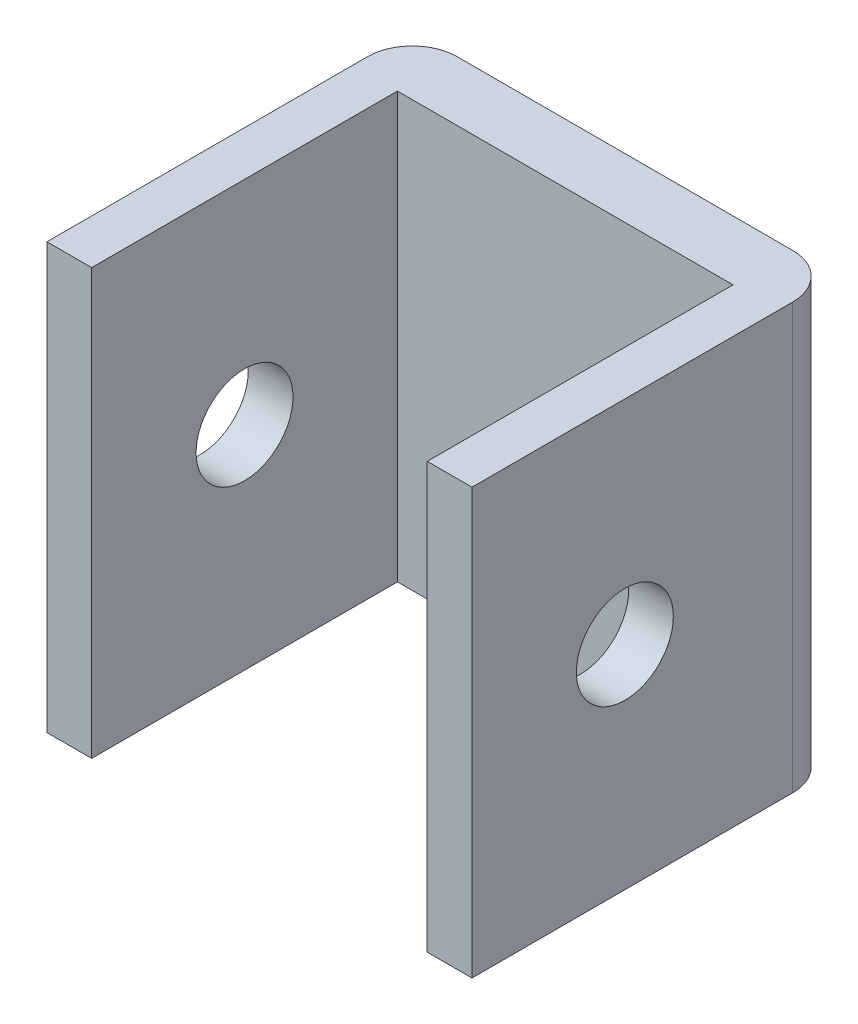
ISO-10303-21;
HEADER;
FILE_DESCRIPTION(('STEP AP214'),'2;1');
FILE_NAME('part.step','',(''),(''),'','','');
FILE_SCHEMA(('AUTOMOTIVE_DESIGN { 1 0 10303 214 1 1 1 1 }'));
ENDSEC;
DATA;
#1=APPLICATION_CONTEXT('core data for automotive mechanical design processes');
#2=APPLICATION_PROTOCOL_DEFINITION('international standard','automotive_design',2000,#1);
#3=PRODUCT_CONTEXT('',#1,'mechanical');
#4=PRODUCT('Part','Part','',(#3));
#5=PRODUCT_RELATED_PRODUCT_CATEGORY('part','',(#4));
#6=PRODUCT_DEFINITION_FORMATION('','',#4);
#7=PRODUCT_DEFINITION_CONTEXT('part definition',#1,'design');
#8=PRODUCT_DEFINITION('design','',#6,#7);
#9=PRODUCT_DEFINITION_SHAPE('','',#8);
#10=(LENGTH_UNIT() NAMED_UNIT(*) SI_UNIT(.MILLI.,.METRE.));
#11=(NAMED_UNIT(*) PLANE_ANGLE_UNIT() SI_UNIT($,.RADIAN.));
#12=(NAMED_UNIT(*) SI_UNIT($,.STERADIAN.) SOLID_ANGLE_UNIT());
#13=UNCERTAINTY_MEASURE_WITH_UNIT(LENGTH_MEASURE(1.E-05),#10,'distance_accuracy_value','');
#14=(GEOMETRIC_REPRESENTATION_CONTEXT(3) GLOBAL_UNCERTAINTY_ASSIGNED_CONTEXT((#13)) GLOBAL_UNIT_ASSIGNED_CONTEXT((#10,
#11,#12)) REPRESENTATION_CONTEXT('',''));
#15=CARTESIAN_POINT('',(0.,0.,0.));
#16=DIRECTION('',(0.,0.,1.));
#17=DIRECTION('',(1.,0.,0.));
#18=AXIS2_PLACEMENT_3D('',#15,#16,#17);
#19=CARTESIAN_POINT('',(-11.25,-14.25,-9.25));
#20=DIRECTION('',(0.,1.,0.));
#21=DIRECTION('',(0.,0.,1.));
#22=AXIS2_PLACEMENT_3D('',#19,#20,#21);
#23=CYLINDRICAL_SURFACE('',#22,3.);
#24=DIRECTION('',(0.,1.,0.));
#25=VECTOR('',#24,1.);
#26=CARTESIAN_POINT('',(-14.25,-14.25,-9.24999999999998));
#27=LINE('',#26,#25);
#28=CARTESIAN_POINT('',(-14.25,-14.25,-9.24999999999998));
#29=VERTEX_POINT('',#28);
#30=CARTESIAN_POINT('',(-14.25,14.25,-9.24999999999998));
#31=VERTEX_POINT('',#30);
#32=EDGE_CURVE('E118',#29,#31,#27,.T.);
#33=ORIENTED_EDGE('',*,*,#32,.T.);
#34=CARTESIAN_POINT('',(-11.25,14.25,-9.25));
#35=DIRECTION('',(0.,1.,0.));
#36=DIRECTION('',(0.,0.,1.));
#37=AXIS2_PLACEMENT_3D('',#34,#35,#36);
#38=CIRCLE('',#37,3.);
#39=CARTESIAN_POINT('',(-11.25,14.25,-12.25));
#40=VERTEX_POINT('',#39);
#41=EDGE_CURVE('E121',#31,#40,#38,.F.);
#42=ORIENTED_EDGE('',*,*,#41,.T.);
#43=DIRECTION('',(0.,1.,0.));
#44=VECTOR('',#43,1.);
#45=CARTESIAN_POINT('',(-11.25,-14.25,-12.25));
#46=LINE('',#45,#44);
#47=CARTESIAN_POINT('',(-11.25,-14.25,-12.25));
#48=VERTEX_POINT('',#47);
#49=EDGE_CURVE('E50',#48,#40,#46,.T.);
#50=ORIENTED_EDGE('',*,*,#49,.F.);
#51=CARTESIAN_POINT('',(-11.25,-14.25,-9.25));
#52=DIRECTION('',(0.,1.,0.));
#53=DIRECTION('',(0.,0.,1.));
#54=AXIS2_PLACEMENT_3D('',#51,#52,#53);
#55=CIRCLE('',#54,3.);
#56=EDGE_CURVE('E123',#29,#48,#55,.F.);
#57=ORIENTED_EDGE('',*,*,#56,.F.);
#58=EDGE_LOOP('',(#33,#42,#50,#57));
#59=FACE_BOUND('',#58,.T.);
#60=ADVANCED_FACE('F41',(#59),#23,.T.);
#61=CARTESIAN_POINT('',(0.,-14.25,-12.25));
#62=DIRECTION('',(0.,0.,1.));
#63=DIRECTION('',(1.,0.,0.));
#64=AXIS2_PLACEMENT_3D('',#61,#62,#63);
#65=PLANE('',#64);
#66=CARTESIAN_POINT('',(0.,0.,-12.25));
#67=DIRECTION('',(0.,0.,1.));
#68=DIRECTION('',(1.,0.,0.));
#69=AXIS2_PLACEMENT_3D('',#66,#67,#68);
#70=CIRCLE('',#69,5.);
#71=CARTESIAN_POINT('',(5.,0.,-12.25));
#72=VERTEX_POINT('',#71);
#73=EDGE_CURVE('E11',#72,#72,#70,.F.);
#74=ORIENTED_EDGE('',*,*,#73,.F.);
#75=EDGE_LOOP('',(#74));
#76=FACE_BOUND('',#75,.T.);
#77=ORIENTED_EDGE('',*,*,#49,.T.);
#78=DIRECTION('',(1.,0.,0.));
#79=VECTOR('',#78,1.);
#80=CARTESIAN_POINT('',(0.,14.25,-12.25));
#81=LINE('',#80,#79);
#82=CARTESIAN_POINT('',(11.25,14.25,-12.25));
#83=VERTEX_POINT('',#82);
#84=EDGE_CURVE('E137',#40,#83,#81,.T.);
#85=ORIENTED_EDGE('',*,*,#84,.T.);
#86=DIRECTION('',(0.,1.,0.));
#87=VECTOR('',#86,1.);
#88=CARTESIAN_POINT('',(11.25,-14.25,-12.25));
#89=LINE('',#88,#87);
#90=CARTESIAN_POINT('',(11.25,-14.25,-12.25));
#91=VERTEX_POINT('',#90);
#92=EDGE_CURVE('E205',#91,#83,#89,.T.);
#93=ORIENTED_EDGE('',*,*,#92,.F.);
#94=DIRECTION('',(1.,0.,0.));
#95=VECTOR('',#94,1.);
#96=CARTESIAN_POINT('',(0.,-14.25,-12.25));
#97=LINE('',#96,#95);
#98=EDGE_CURVE('E58',#48,#91,#97,.T.);
#99=ORIENTED_EDGE('',*,*,#98,.F.);
#100=EDGE_LOOP('',(#77,#85,#93,#99));
#101=FACE_BOUND('',#100,.T.);
#102=ADVANCED_FACE('F264',(#76,#101),#65,.F.);
#103=CARTESIAN_POINT('',(11.25,-14.25,-9.25));
#104=DIRECTION('',(0.,1.,0.));
#105=DIRECTION('',(0.,0.,1.));
#106=AXIS2_PLACEMENT_3D('',#103,#104,#105);
#107=CYLINDRICAL_SURFACE('',#106,3.);
#108=ORIENTED_EDGE('',*,*,#92,.T.);
#109=CARTESIAN_POINT('',(11.25,14.25,-9.25));
#110=DIRECTION('',(0.,1.,0.));
#111=DIRECTION('',(0.,0.,1.));
#112=AXIS2_PLACEMENT_3D('',#109,#110,#111);
#113=CIRCLE('',#112,3.);
#114=CARTESIAN_POINT('',(14.25,14.25,-9.24999999999998));
#115=VERTEX_POINT('',#114);
#116=EDGE_CURVE('E167',#83,#115,#113,.F.);
#117=ORIENTED_EDGE('',*,*,#116,.T.);
#118=DIRECTION('',(0.,1.,0.));
#119=VECTOR('',#118,1.);
#120=CARTESIAN_POINT('',(14.25,-14.25,-9.24999999999998));
#121=LINE('',#120,#119);
#122=CARTESIAN_POINT('',(14.25,-14.25,-9.24999999999998));
#123=VERTEX_POINT('',#122);
#124=EDGE_CURVE('E208',#123,#115,#121,.T.);
#125=ORIENTED_EDGE('',*,*,#124,.F.);
#126=CARTESIAN_POINT('',(11.25,-14.25,-9.25));
#127=DIRECTION('',(0.,1.,0.));
#128=DIRECTION('',(0.,0.,1.));
#129=AXIS2_PLACEMENT_3D('',#126,#127,#128);
#130=CIRCLE('',#129,3.);
#131=EDGE_CURVE('E198',#91,#123,#130,.F.);
#132=ORIENTED_EDGE('',*,*,#131,.F.);
#133=EDGE_LOOP('',(#108,#117,#125,#132));
#134=FACE_BOUND('',#133,.T.);
#135=ADVANCED_FACE('F266',(#134),#107,.T.);
#136=CARTESIAN_POINT('',(14.25,-14.25,0.));
#137=DIRECTION('',(1.,0.,0.));
#138=DIRECTION('',(0.,0.,-1.));
#139=AXIS2_PLACEMENT_3D('',#136,#137,#138);
#140=PLANE('',#139);
#141=CARTESIAN_POINT('',(14.25,0.,2.));
#142=DIRECTION('',(1.,0.,0.));
#143=DIRECTION('',(0.,0.,-1.));
#144=AXIS2_PLACEMENT_3D('',#141,#142,#143);
#145=CIRCLE('',#144,3.25);
#146=CARTESIAN_POINT('',(14.25,0.,-1.25));
#147=VERTEX_POINT('',#146);
#148=EDGE_CURVE('E419',#147,#147,#145,.T.);
#149=ORIENTED_EDGE('',*,*,#148,.F.);
#150=EDGE_LOOP('',(#149));
#151=FACE_BOUND('',#150,.T.);
#152=ORIENTED_EDGE('',*,*,#124,.T.);
#153=DIRECTION('',(0.,0.,-1.));
#154=VECTOR('',#153,1.);
#155=CARTESIAN_POINT('',(14.25,14.25,0.));
#156=LINE('',#155,#154);
#157=CARTESIAN_POINT('',(14.25,14.25,12.25));
#158=VERTEX_POINT('',#157);
#159=EDGE_CURVE('E163',#158,#115,#156,.T.);
#160=ORIENTED_EDGE('',*,*,#159,.F.);
#161=DIRECTION('',(0.,1.,0.));
#162=VECTOR('',#161,1.);
#163=CARTESIAN_POINT('',(14.25,-14.25,12.25));
#164=LINE('',#163,#162);
#165=CARTESIAN_POINT('',(14.25,-14.25,12.25));
#166=VERTEX_POINT('',#165);
#167=EDGE_CURVE('E211',#166,#158,#164,.T.);
#168=ORIENTED_EDGE('',*,*,#167,.F.);
#169=DIRECTION('',(0.,0.,-1.));
#170=VECTOR('',#169,1.);
#171=CARTESIAN_POINT('',(14.25,-14.25,0.));
#172=LINE('',#171,#170);
#173=EDGE_CURVE('E194',#166,#123,#172,.T.);
#174=ORIENTED_EDGE('',*,*,#173,.T.);
#175=EDGE_LOOP('',(#152,#160,#168,#174));
#176=FACE_BOUND('',#175,.T.);
#177=ADVANCED_FACE('F285',(#151,#176),#140,.T.);
#178=CARTESIAN_POINT('',(0.,-14.25,12.25));
#179=DIRECTION('',(0.,0.,1.));
#180=DIRECTION('',(1.,0.,0.));
#181=AXIS2_PLACEMENT_3D('',#178,#179,#180);
#182=PLANE('',#181);
#183=ORIENTED_EDGE('',*,*,#167,.T.);
#184=DIRECTION('',(1.,0.,0.));
#185=VECTOR('',#184,1.);
#186=CARTESIAN_POINT('',(0.,14.25,12.25));
#187=LINE('',#186,#185);
#188=CARTESIAN_POINT('',(11.25,14.25,12.25));
#189=VERTEX_POINT('',#188);
#190=EDGE_CURVE('E149',#189,#158,#187,.T.);
#191=ORIENTED_EDGE('',*,*,#190,.F.);
#192=DIRECTION('',(0.,1.,0.));
#193=VECTOR('',#192,1.);
#194=CARTESIAN_POINT('',(11.25,-14.25,12.25));
#195=LINE('',#194,#193);
#196=CARTESIAN_POINT('',(11.25,-14.25,12.25));
#197=VERTEX_POINT('',#196);
#198=EDGE_CURVE('E214',#197,#189,#195,.T.);
#199=ORIENTED_EDGE('',*,*,#198,.F.);
#200=DIRECTION('',(1.,0.,0.));
#201=VECTOR('',#200,1.);
#202=CARTESIAN_POINT('',(0.,-14.25,12.25));
#203=LINE('',#202,#201);
#204=EDGE_CURVE('E183',#197,#166,#203,.T.);
#205=ORIENTED_EDGE('',*,*,#204,.T.);
#206=EDGE_LOOP('',(#183,#191,#199,#205));
#207=FACE_BOUND('',#206,.T.);
#208=ADVANCED_FACE('F278',(#207),#182,.T.);
#209=CARTESIAN_POINT('',(11.25,-14.25,0.));
#210=DIRECTION('',(-1.,0.,0.));
#211=DIRECTION('',(0.,0.,1.));
#212=AXIS2_PLACEMENT_3D('',#209,#210,#211);
#213=PLANE('',#212);
#214=CARTESIAN_POINT('',(11.25,0.,2.));
#215=DIRECTION('',(-1.,0.,0.));
#216=DIRECTION('',(0.,0.,1.));
#217=AXIS2_PLACEMENT_3D('',#214,#215,#216);
#218=CIRCLE('',#217,3.25);
#219=CARTESIAN_POINT('',(11.25,0.,5.25));
#220=VERTEX_POINT('',#219);
#221=EDGE_CURVE('E240',#220,#220,#218,.T.);
#222=ORIENTED_EDGE('',*,*,#221,.F.);
#223=EDGE_LOOP('',(#222));
#224=FACE_BOUND('',#223,.T.);
#225=ORIENTED_EDGE('',*,*,#198,.T.);
#226=DIRECTION('',(0.,0.,1.));
#227=VECTOR('',#226,1.);
#228=CARTESIAN_POINT('',(11.25,14.25,0.));
#229=LINE('',#228,#227);
#230=CARTESIAN_POINT('',(11.25,14.25,-8.25));
#231=VERTEX_POINT('',#230);
#232=EDGE_CURVE('E159',#231,#189,#229,.T.);
#233=ORIENTED_EDGE('',*,*,#232,.F.);
#234=DIRECTION('',(0.,1.,0.));
#235=VECTOR('',#234,1.);
#236=CARTESIAN_POINT('',(11.25,-14.25,-8.25));
#237=LINE('',#236,#235);
#238=CARTESIAN_POINT('',(11.25,-14.25,-8.25));
#239=VERTEX_POINT('',#238);
#240=EDGE_CURVE('E217',#239,#231,#237,.T.);
#241=ORIENTED_EDGE('',*,*,#240,.F.);
#242=DIRECTION('',(0.,0.,1.));
#243=VECTOR('',#242,1.);
#244=CARTESIAN_POINT('',(11.25,-14.25,0.));
#245=LINE('',#244,#243);
#246=EDGE_CURVE('E190',#239,#197,#245,.T.);
#247=ORIENTED_EDGE('',*,*,#246,.T.);
#248=EDGE_LOOP('',(#225,#233,#241,#247));
#249=FACE_BOUND('',#248,.T.);
#250=ADVANCED_FACE('F293',(#224,#249),#213,.T.);
#251=CARTESIAN_POINT('',(0.,-14.25,-8.25));
#252=DIRECTION('',(0.,0.,1.));
#253=DIRECTION('',(1.,0.,0.));
#254=AXIS2_PLACEMENT_3D('',#251,#252,#253);
#255=PLANE('',#254);
#256=CARTESIAN_POINT('',(0.,0.,-8.25));
#257=DIRECTION('',(0.,0.,1.));
#258=DIRECTION('',(1.,0.,0.));
#259=AXIS2_PLACEMENT_3D('',#256,#257,#258);
#260=CIRCLE('',#259,1.5);
#261=CARTESIAN_POINT('',(1.5,0.,-8.25));
#262=VERTEX_POINT('',#261);
#263=EDGE_CURVE('E227',#262,#262,#260,.T.);
#264=ORIENTED_EDGE('',*,*,#263,.F.);
#265=EDGE_LOOP('',(#264));
#266=FACE_BOUND('',#265,.T.);
#267=ORIENTED_EDGE('',*,*,#240,.T.);
#268=DIRECTION('',(1.,0.,0.));
#269=VECTOR('',#268,1.);
#270=CARTESIAN_POINT('',(0.,14.25,-8.25));
#271=LINE('',#270,#269);
#272=CARTESIAN_POINT('',(-11.25,14.25,-8.25));
#273=VERTEX_POINT('',#272);
#274=EDGE_CURVE('E155',#273,#231,#271,.T.);
#275=ORIENTED_EDGE('',*,*,#274,.F.);
#276=DIRECTION('',(0.,1.,0.));
#277=VECTOR('',#276,1.);
#278=CARTESIAN_POINT('',(-11.25,-14.25,-8.25));
#279=LINE('',#278,#277);
#280=CARTESIAN_POINT('',(-11.25,-14.25,-8.25));
#281=VERTEX_POINT('',#280);
#282=EDGE_CURVE('E220',#281,#273,#279,.T.);
#283=ORIENTED_EDGE('',*,*,#282,.F.);
#284=DIRECTION('',(1.,0.,0.));
#285=VECTOR('',#284,1.);
#286=CARTESIAN_POINT('',(0.,-14.25,-8.25));
#287=LINE('',#286,#285);
#288=EDGE_CURVE('E186',#281,#239,#287,.T.);
#289=ORIENTED_EDGE('',*,*,#288,.T.);
#290=EDGE_LOOP('',(#267,#275,#283,#289));
#291=FACE_BOUND('',#290,.T.);
#292=ADVANCED_FACE('F430',(#266,#291),#255,.T.);
#293=CARTESIAN_POINT('',(-11.25,-14.25,0.));
#294=DIRECTION('',(-1.,0.,0.));
#295=DIRECTION('',(0.,0.,1.));
#296=AXIS2_PLACEMENT_3D('',#293,#294,#295);
#297=PLANE('',#296);
#298=CARTESIAN_POINT('',(-11.25,0.,2.));
#299=DIRECTION('',(-1.,0.,0.));
#300=DIRECTION('',(0.,0.,1.));
#301=AXIS2_PLACEMENT_3D('',#298,#299,#300);
#302=CIRCLE('',#301,3.25);
#303=CARTESIAN_POINT('',(-11.25,0.,5.25));
#304=VERTEX_POINT('',#303);
#305=EDGE_CURVE('E246',#304,#304,#302,.T.);
#306=ORIENTED_EDGE('',*,*,#305,.T.);
#307=EDGE_LOOP('',(#306));
#308=FACE_BOUND('',#307,.T.);
#309=ORIENTED_EDGE('',*,*,#282,.T.);
#310=DIRECTION('',(0.,0.,1.));
#311=VECTOR('',#310,1.);
#312=CARTESIAN_POINT('',(-11.25,14.25,0.));
#313=LINE('',#312,#311);
#314=CARTESIAN_POINT('',(-11.25,14.25,12.25));
#315=VERTEX_POINT('',#314);
#316=EDGE_CURVE('E147',#273,#315,#313,.T.);
#317=ORIENTED_EDGE('',*,*,#316,.T.);
#318=DIRECTION('',(0.,1.,0.));
#319=VECTOR('',#318,1.);
#320=CARTESIAN_POINT('',(-11.25,-14.25,12.25));
#321=LINE('',#320,#319);
#322=CARTESIAN_POINT('',(-11.25,-14.25,12.25));
#323=VERTEX_POINT('',#322);
#324=EDGE_CURVE('E223',#323,#315,#321,.T.);
#325=ORIENTED_EDGE('',*,*,#324,.F.);
#326=DIRECTION('',(0.,0.,1.));
#327=VECTOR('',#326,1.);
#328=CARTESIAN_POINT('',(-11.25,-14.25,0.));
#329=LINE('',#328,#327);
#330=EDGE_CURVE('E182',#281,#323,#329,.T.);
#331=ORIENTED_EDGE('',*,*,#330,.F.);
#332=EDGE_LOOP('',(#309,#317,#325,#331));
#333=FACE_BOUND('',#332,.T.);
#334=ADVANCED_FACE('F329',(#308,#333),#297,.F.);
#335=ORIENTED_EDGE('',*,*,#324,.T.);
#336=CARTESIAN_POINT('',(-14.25,14.25,12.25));
#337=VERTEX_POINT('',#336);
#338=EDGE_CURVE('E144',#337,#315,#187,.T.);
#339=ORIENTED_EDGE('',*,*,#338,.F.);
#340=DIRECTION('',(0.,1.,0.));
#341=VECTOR('',#340,1.);
#342=CARTESIAN_POINT('',(-14.25,-14.25,12.25));
#343=LINE('',#342,#341);
#344=CARTESIAN_POINT('',(-14.25,-14.25,12.25));
#345=VERTEX_POINT('',#344);
#346=EDGE_CURVE('E128',#345,#337,#343,.T.);
#347=ORIENTED_EDGE('',*,*,#346,.F.);
#348=EDGE_CURVE('E178',#345,#323,#203,.T.);
#349=ORIENTED_EDGE('',*,*,#348,.T.);
#350=EDGE_LOOP('',(#335,#339,#347,#349));
#351=FACE_BOUND('',#350,.T.);
#352=ADVANCED_FACE('F295',(#351),#182,.T.);
#353=CARTESIAN_POINT('',(-14.25,-14.25,0.));
#354=DIRECTION('',(1.,0.,0.));
#355=DIRECTION('',(0.,0.,-1.));
#356=AXIS2_PLACEMENT_3D('',#353,#354,#355);
#357=PLANE('',#356);
#358=CARTESIAN_POINT('',(-14.25,0.,2.));
#359=DIRECTION('',(1.,0.,0.));
#360=DIRECTION('',(0.,0.,-1.));
#361=AXIS2_PLACEMENT_3D('',#358,#359,#360);
#362=CIRCLE('',#361,3.25);
#363=CARTESIAN_POINT('',(-14.25,0.,-1.25));
#364=VERTEX_POINT('',#363);
#365=EDGE_CURVE('E44',#364,#364,#362,.T.);
#366=ORIENTED_EDGE('',*,*,#365,.T.);
#367=EDGE_LOOP('',(#366));
#368=FACE_BOUND('',#367,.T.);
#369=ORIENTED_EDGE('',*,*,#346,.T.);
#370=DIRECTION('',(0.,0.,-1.));
#371=VECTOR('',#370,1.);
#372=CARTESIAN_POINT('',(-14.25,14.25,0.));
#373=LINE('',#372,#371);
#374=EDGE_CURVE('E134',#337,#31,#373,.T.);
#375=ORIENTED_EDGE('',*,*,#374,.T.);
#376=ORIENTED_EDGE('',*,*,#32,.F.);
#377=DIRECTION('',(0.,0.,-1.));
#378=VECTOR('',#377,1.);
#379=CARTESIAN_POINT('',(-14.25,-14.25,0.));
#380=LINE('',#379,#378);
#381=EDGE_CURVE('E175',#345,#29,#380,.T.);
#382=ORIENTED_EDGE('',*,*,#381,.F.);
#383=EDGE_LOOP('',(#369,#375,#376,#382));
#384=FACE_BOUND('',#383,.T.);
#385=ADVANCED_FACE('F141',(#368,#384),#357,.F.);
#386=CARTESIAN_POINT('',(0.,-14.25,0.));
#387=DIRECTION('',(0.,1.,0.));
#388=DIRECTION('',(0.,0.,1.));
#389=AXIS2_PLACEMENT_3D('',#386,#387,#388);
#390=PLANE('',#389);
#391=ORIENTED_EDGE('',*,*,#56,.T.);
#392=ORIENTED_EDGE('',*,*,#98,.T.);
#393=ORIENTED_EDGE('',*,*,#131,.T.);
#394=ORIENTED_EDGE('',*,*,#173,.F.);
#395=ORIENTED_EDGE('',*,*,#204,.F.);
#396=ORIENTED_EDGE('',*,*,#246,.F.);
#397=ORIENTED_EDGE('',*,*,#288,.F.);
#398=ORIENTED_EDGE('',*,*,#330,.T.);
#399=ORIENTED_EDGE('',*,*,#348,.F.);
#400=ORIENTED_EDGE('',*,*,#381,.T.);
#401=EDGE_LOOP('',(#391,#392,#393,#394,#395,#396,#397,#398,#399,#400));
#402=FACE_BOUND('',#401,.T.);
#403=ADVANCED_FACE('F272',(#402),#390,.F.);
#404=CARTESIAN_POINT('',(0.,14.25,0.));
#405=DIRECTION('',(0.,1.,0.));
#406=DIRECTION('',(0.,0.,1.));
#407=AXIS2_PLACEMENT_3D('',#404,#405,#406);
#408=PLANE('',#407);
#409=ORIENTED_EDGE('',*,*,#41,.F.);
#410=ORIENTED_EDGE('',*,*,#374,.F.);
#411=ORIENTED_EDGE('',*,*,#338,.T.);
#412=ORIENTED_EDGE('',*,*,#316,.F.);
#413=ORIENTED_EDGE('',*,*,#274,.T.);
#414=ORIENTED_EDGE('',*,*,#232,.T.);
#415=ORIENTED_EDGE('',*,*,#190,.T.);
#416=ORIENTED_EDGE('',*,*,#159,.T.);
#417=ORIENTED_EDGE('',*,*,#116,.F.);
#418=ORIENTED_EDGE('',*,*,#84,.F.);
#419=EDGE_LOOP('',(#409,#410,#411,#412,#413,#414,#415,#416,#417,#418));
#420=FACE_BOUND('',#419,.T.);
#421=ADVANCED_FACE('F132',(#420),#408,.T.);
#422=CARTESIAN_POINT('',(0.,0.,-19.25));
#423=DIRECTION('',(0.,0.,1.));
#424=DIRECTION('',(1.,0.,0.));
#425=AXIS2_PLACEMENT_3D('',#422,#423,#424);
#426=CYLINDRICAL_SURFACE('',#425,5.);
#427=CARTESIAN_POINT('',(0.,0.,-19.25));
#428=DIRECTION('',(0.,0.,-1.));
#429=DIRECTION('',(-1.,0.,0.));
#430=AXIS2_PLACEMENT_3D('',#427,#428,#429);
#431=CIRCLE('',#430,5.);
#432=CARTESIAN_POINT('',(-5.,0.,-19.25));
#433=VERTEX_POINT('',#432);
#434=EDGE_CURVE('E139',#433,#433,#431,.T.);
#435=ORIENTED_EDGE('',*,*,#434,.F.);
#436=EDGE_LOOP('',(#435));
#437=FACE_BOUND('',#436,.T.);
#438=ORIENTED_EDGE('',*,*,#73,.T.);
#439=EDGE_LOOP('',(#438));
#440=FACE_BOUND('',#439,.T.);
#441=ADVANCED_FACE('F258',(#437,#440),#426,.T.);
#442=CARTESIAN_POINT('',(0.,0.,-19.25));
#443=DIRECTION('',(0.,0.,-1.));
#444=DIRECTION('',(-1.,0.,0.));
#445=AXIS2_PLACEMENT_3D('',#442,#443,#444);
#446=PLANE('',#445);
#447=CARTESIAN_POINT('',(0.,0.,-19.25));
#448=DIRECTION('',(0.,0.,-1.));
#449=DIRECTION('',(-1.,0.,0.));
#450=AXIS2_PLACEMENT_3D('',#447,#448,#449);
#451=CIRCLE('',#450,2.25);
#452=CARTESIAN_POINT('',(-2.25,0.,-19.25));
#453=VERTEX_POINT('',#452);
#454=EDGE_CURVE('E230',#453,#453,#451,.T.);
#455=ORIENTED_EDGE('',*,*,#454,.F.);
#456=EDGE_LOOP('',(#455));
#457=FACE_BOUND('',#456,.T.);
#458=ORIENTED_EDGE('',*,*,#434,.T.);
#459=EDGE_LOOP('',(#458));
#460=FACE_BOUND('',#459,.T.);
#461=ADVANCED_FACE('F256',(#457,#460),#446,.T.);
#462=CARTESIAN_POINT('',(0.,0.,-17.75));
#463=DIRECTION('',(0.,0.,-1.));
#464=DIRECTION('',(-1.,0.,0.));
#465=AXIS2_PLACEMENT_3D('',#462,#463,#464);
#466=CYLINDRICAL_SURFACE('',#465,2.25);
#467=CARTESIAN_POINT('',(0.,0.,-17.75));
#468=DIRECTION('',(0.,0.,-1.));
#469=DIRECTION('',(-1.,0.,0.));
#470=AXIS2_PLACEMENT_3D('',#467,#468,#469);
#471=CIRCLE('',#470,2.25);
#472=CARTESIAN_POINT('',(-2.25,0.,-17.75));
#473=VERTEX_POINT('',#472);
#474=EDGE_CURVE('E237',#473,#473,#471,.T.);
#475=ORIENTED_EDGE('',*,*,#474,.F.);
#476=EDGE_LOOP('',(#475));
#477=FACE_BOUND('',#476,.T.);
#478=ORIENTED_EDGE('',*,*,#454,.T.);
#479=EDGE_LOOP('',(#478));
#480=FACE_BOUND('',#479,.T.);
#481=ADVANCED_FACE('F359',(#477,#480),#466,.F.);
#482=CARTESIAN_POINT('',(0.,0.,-17.75));
#483=DIRECTION('',(0.,0.,-1.));
#484=DIRECTION('',(-1.,0.,0.));
#485=AXIS2_PLACEMENT_3D('',#482,#483,#484);
#486=PLANE('',#485);
#487=CARTESIAN_POINT('',(0.,0.,-17.75));
#488=DIRECTION('',(0.,0.,-1.));
#489=DIRECTION('',(-1.,0.,0.));
#490=AXIS2_PLACEMENT_3D('',#487,#488,#489);
#491=CIRCLE('',#490,1.5);
#492=CARTESIAN_POINT('',(-1.5,0.,-17.75));
#493=VERTEX_POINT('',#492);
#494=EDGE_CURVE('E231',#493,#493,#491,.T.);
#495=ORIENTED_EDGE('',*,*,#494,.F.);
#496=EDGE_LOOP('',(#495));
#497=FACE_BOUND('',#496,.T.);
#498=ORIENTED_EDGE('',*,*,#474,.T.);
#499=EDGE_LOOP('',(#498));
#500=FACE_BOUND('',#499,.T.);
#501=ADVANCED_FACE('F367',(#497,#500),#486,.T.);
#502=CARTESIAN_POINT('',(0.,0.,-7.25));
#503=DIRECTION('',(0.,0.,-1.));
#504=DIRECTION('',(-1.,0.,0.));
#505=AXIS2_PLACEMENT_3D('',#502,#503,#504);
#506=CYLINDRICAL_SURFACE('',#505,1.5);
#507=ORIENTED_EDGE('',*,*,#263,.T.);
#508=EDGE_LOOP('',(#507));
#509=FACE_BOUND('',#508,.T.);
#510=ORIENTED_EDGE('',*,*,#494,.T.);
#511=EDGE_LOOP('',(#510));
#512=FACE_BOUND('',#511,.T.);
#513=ADVANCED_FACE('F376',(#509,#512),#506,.F.);
#514=CARTESIAN_POINT('',(-18.25,0.,2.));
#515=DIRECTION('',(1.,0.,0.));
#516=DIRECTION('',(0.,0.,-1.));
#517=AXIS2_PLACEMENT_3D('',#514,#515,#516);
#518=CYLINDRICAL_SURFACE('',#517,3.25);
#519=ORIENTED_EDGE('',*,*,#365,.F.);
#520=EDGE_LOOP('',(#519));
#521=FACE_BOUND('',#520,.T.);
#522=ORIENTED_EDGE('',*,*,#305,.F.);
#523=EDGE_LOOP('',(#522));
#524=FACE_BOUND('',#523,.T.);
#525=ADVANCED_FACE('F384',(#521,#524),#518,.F.);
#526=ORIENTED_EDGE('',*,*,#221,.T.);
#527=EDGE_LOOP('',(#526));
#528=FACE_BOUND('',#527,.T.);
#529=ORIENTED_EDGE('',*,*,#148,.T.);
#530=EDGE_LOOP('',(#529));
#531=FACE_BOUND('',#530,.T.);
#532=ADVANCED_FACE('F391',(#528,#531),#518,.F.);
#533=CLOSED_SHELL('',(#60,#102,#135,#177,#208,#250,#292,#334,#352,#385,#403,#421,#441,#461,#481,
#501,#513,#525,#532));
#534=MANIFOLD_SOLID_BREP('B2',#533);
#535=ADVANCED_BREP_SHAPE_REPRESENTATION('',(#18,#534),#14);
#536=SHAPE_DEFINITION_REPRESENTATION(#9,#535);
ENDSEC;
END-ISO-10303-21;
